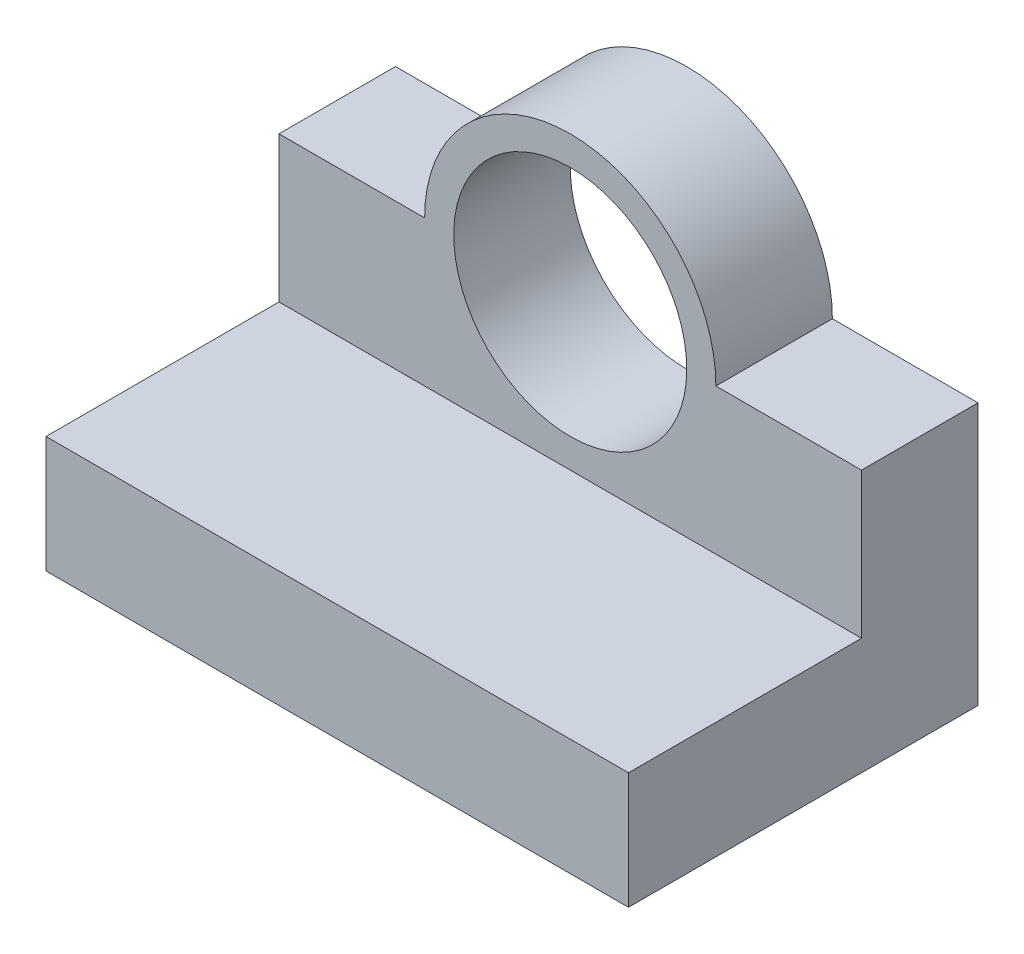
ISO-10303-21;
HEADER;
FILE_DESCRIPTION(('STEP AP214'),'2;1');
FILE_NAME('part.step','',(''),(''),'','','');
FILE_SCHEMA(('AUTOMOTIVE_DESIGN { 1 0 10303 214 1 1 1 1 }'));
ENDSEC;
DATA;
#1=APPLICATION_CONTEXT('core data for automotive mechanical design processes');
#2=APPLICATION_PROTOCOL_DEFINITION('international standard','automotive_design',2000,#1);
#3=PRODUCT_CONTEXT('',#1,'mechanical');
#4=PRODUCT('Part','Part','',(#3));
#5=PRODUCT_RELATED_PRODUCT_CATEGORY('part','',(#4));
#6=PRODUCT_DEFINITION_FORMATION('','',#4);
#7=PRODUCT_DEFINITION_CONTEXT('part definition',#1,'design');
#8=PRODUCT_DEFINITION('design','',#6,#7);
#9=PRODUCT_DEFINITION_SHAPE('','',#8);
#10=(LENGTH_UNIT() NAMED_UNIT(*) SI_UNIT(.MILLI.,.METRE.));
#11=(NAMED_UNIT(*) PLANE_ANGLE_UNIT() SI_UNIT($,.RADIAN.));
#12=(NAMED_UNIT(*) SI_UNIT($,.STERADIAN.) SOLID_ANGLE_UNIT());
#13=UNCERTAINTY_MEASURE_WITH_UNIT(LENGTH_MEASURE(1.E-05),#10,'distance_accuracy_value','');
#14=(GEOMETRIC_REPRESENTATION_CONTEXT(3) GLOBAL_UNCERTAINTY_ASSIGNED_CONTEXT((#13)) GLOBAL_UNIT_ASSIGNED_CONTEXT((#10,
#11,#12)) REPRESENTATION_CONTEXT('',''));
#15=CARTESIAN_POINT('',(0.,0.,0.));
#16=DIRECTION('',(0.,0.,1.));
#17=DIRECTION('',(1.,0.,0.));
#18=AXIS2_PLACEMENT_3D('',#15,#16,#17);
#19=CARTESIAN_POINT('',(100.,-35.,-30.));
#20=DIRECTION('',(0.,0.,1.));
#21=DIRECTION('',(1.,0.,0.));
#22=AXIS2_PLACEMENT_3D('',#19,#20,#21);
#23=PLANE('',#22);
#24=CARTESIAN_POINT('',(50.,10.,-30.));
#25=DIRECTION('',(0.,0.,1.));
#26=DIRECTION('',(1.,0.,0.));
#27=AXIS2_PLACEMENT_3D('',#24,#25,#26);
#28=CIRCLE('',#27,20.);
#29=CARTESIAN_POINT('',(70.,10.,-30.));
#30=VERTEX_POINT('',#29);
#31=EDGE_CURVE('E142',#30,#30,#28,.T.);
#32=ORIENTED_EDGE('',*,*,#31,.T.);
#33=EDGE_LOOP('',(#32));
#34=FACE_BOUND('',#33,.T.);
#35=CARTESIAN_POINT('',(50.,10.,-30.));
#36=DIRECTION('',(0.,0.,1.));
#37=DIRECTION('',(1.,0.,0.));
#38=AXIS2_PLACEMENT_3D('',#35,#36,#37);
#39=CIRCLE('',#38,25.);
#40=CARTESIAN_POINT('',(75.,10.,-30.));
#41=VERTEX_POINT('',#40);
#42=CARTESIAN_POINT('',(25.,10.,-30.));
#43=VERTEX_POINT('',#42);
#44=EDGE_CURVE('E115',#41,#43,#39,.T.);
#45=ORIENTED_EDGE('',*,*,#44,.F.);
#46=DIRECTION('',(1.,0.,0.));
#47=VECTOR('',#46,1.);
#48=CARTESIAN_POINT('',(0.,9.99999999999999,-30.));
#49=LINE('',#48,#47);
#50=CARTESIAN_POINT('',(100.,10.,-30.));
#51=VERTEX_POINT('',#50);
#52=EDGE_CURVE('E119',#41,#51,#49,.T.);
#53=ORIENTED_EDGE('',*,*,#52,.T.);
#54=DIRECTION('',(0.,1.,0.));
#55=VECTOR('',#54,1.);
#56=CARTESIAN_POINT('',(100.,-35.,-30.));
#57=LINE('',#56,#55);
#58=CARTESIAN_POINT('',(100.,-35.,-30.));
#59=VERTEX_POINT('',#58);
#60=EDGE_CURVE('E160',#59,#51,#57,.T.);
#61=ORIENTED_EDGE('',*,*,#60,.F.);
#62=DIRECTION('',(-1.,0.,0.));
#63=VECTOR('',#62,1.);
#64=CARTESIAN_POINT('',(100.,-35.,-30.));
#65=LINE('',#64,#63);
#66=CARTESIAN_POINT('',(0.,-35.,-30.));
#67=VERTEX_POINT('',#66);
#68=EDGE_CURVE('E173',#59,#67,#65,.T.);
#69=ORIENTED_EDGE('',*,*,#68,.T.);
#70=DIRECTION('',(0.,1.,0.));
#71=VECTOR('',#70,1.);
#72=CARTESIAN_POINT('',(0.,-35.,-30.));
#73=LINE('',#72,#71);
#74=CARTESIAN_POINT('',(0.,9.99999999999999,-30.));
#75=VERTEX_POINT('',#74);
#76=EDGE_CURVE('E157',#67,#75,#73,.T.);
#77=ORIENTED_EDGE('',*,*,#76,.T.);
#78=DIRECTION('',(1.,0.,0.));
#79=VECTOR('',#78,1.);
#80=CARTESIAN_POINT('',(0.,10.,-30.));
#81=LINE('',#80,#79);
#82=EDGE_CURVE('E55',#75,#43,#81,.T.);
#83=ORIENTED_EDGE('',*,*,#82,.T.);
#84=EDGE_LOOP('',(#45,#53,#61,#69,#77,#83));
#85=FACE_BOUND('',#84,.T.);
#86=ADVANCED_FACE('F39',(#34,#85),#23,.F.);
#87=CARTESIAN_POINT('',(100.,35.,-9.99999999999999));
#88=DIRECTION('',(0.,0.,-1.));
#89=DIRECTION('',(0.,1.,0.));
#90=AXIS2_PLACEMENT_3D('',#87,#88,#89);
#91=PLANE('',#90);
#92=CARTESIAN_POINT('',(50.,10.,-9.99999999999999));
#93=DIRECTION('',(0.,0.,-1.));
#94=DIRECTION('',(0.,1.,0.));
#95=AXIS2_PLACEMENT_3D('',#92,#93,#94);
#96=CIRCLE('',#95,20.);
#97=CARTESIAN_POINT('',(50.,30.,-9.99999999999999));
#98=VERTEX_POINT('',#97);
#99=EDGE_CURVE('E42',#98,#98,#96,.T.);
#100=ORIENTED_EDGE('',*,*,#99,.T.);
#101=EDGE_LOOP('',(#100));
#102=FACE_BOUND('',#101,.T.);
#103=DIRECTION('',(1.,0.,0.));
#104=VECTOR('',#103,1.);
#105=CARTESIAN_POINT('',(0.,9.99999999999999,-10.));
#106=LINE('',#105,#104);
#107=CARTESIAN_POINT('',(75.,10.,-10.));
#108=VERTEX_POINT('',#107);
#109=CARTESIAN_POINT('',(100.,10.,-10.));
#110=VERTEX_POINT('',#109);
#111=EDGE_CURVE('E137',#108,#110,#106,.T.);
#112=ORIENTED_EDGE('',*,*,#111,.F.);
#113=CARTESIAN_POINT('',(50.,10.,-10.));
#114=DIRECTION('',(0.,0.,1.));
#115=DIRECTION('',(1.,0.,0.));
#116=AXIS2_PLACEMENT_3D('',#113,#114,#115);
#117=CIRCLE('',#116,25.);
#118=CARTESIAN_POINT('',(25.,10.,-10.));
#119=VERTEX_POINT('',#118);
#120=EDGE_CURVE('E129',#108,#119,#117,.T.);
#121=ORIENTED_EDGE('',*,*,#120,.T.);
#122=DIRECTION('',(1.,0.,0.));
#123=VECTOR('',#122,1.);
#124=CARTESIAN_POINT('',(0.,10.,-10.));
#125=LINE('',#124,#123);
#126=CARTESIAN_POINT('',(0.,10.,-10.));
#127=VERTEX_POINT('',#126);
#128=EDGE_CURVE('E123',#127,#119,#125,.T.);
#129=ORIENTED_EDGE('',*,*,#128,.F.);
#130=DIRECTION('',(0.,-1.,0.));
#131=VECTOR('',#130,1.);
#132=CARTESIAN_POINT('',(0.,35.,-9.99999999999999));
#133=LINE('',#132,#131);
#134=CARTESIAN_POINT('',(0.,-15.,-10.));
#135=VERTEX_POINT('',#134);
#136=EDGE_CURVE('E176',#127,#135,#133,.T.);
#137=ORIENTED_EDGE('',*,*,#136,.T.);
#138=DIRECTION('',(-1.,0.,0.));
#139=VECTOR('',#138,1.);
#140=CARTESIAN_POINT('',(100.,-15.,-10.));
#141=LINE('',#140,#139);
#142=CARTESIAN_POINT('',(100.,-15.,-10.));
#143=VERTEX_POINT('',#142);
#144=EDGE_CURVE('E11',#143,#135,#141,.T.);
#145=ORIENTED_EDGE('',*,*,#144,.F.);
#146=DIRECTION('',(0.,-1.,0.));
#147=VECTOR('',#146,1.);
#148=CARTESIAN_POINT('',(100.,35.,-9.99999999999999));
#149=LINE('',#148,#147);
#150=EDGE_CURVE('E92',#110,#143,#149,.T.);
#151=ORIENTED_EDGE('',*,*,#150,.F.);
#152=EDGE_LOOP('',(#112,#121,#129,#137,#145,#151));
#153=FACE_BOUND('',#152,.T.);
#154=ADVANCED_FACE('F220',(#102,#153),#91,.F.);
#155=CARTESIAN_POINT('',(100.,-15.,30.));
#156=DIRECTION('',(0.,-1.,0.));
#157=DIRECTION('',(0.,0.,-1.));
#158=AXIS2_PLACEMENT_3D('',#155,#156,#157);
#159=PLANE('',#158);
#160=DIRECTION('',(0.,0.,1.));
#161=VECTOR('',#160,1.);
#162=CARTESIAN_POINT('',(0.,-15.,30.));
#163=LINE('',#162,#161);
#164=CARTESIAN_POINT('',(0.,-15.,30.));
#165=VERTEX_POINT('',#164);
#166=EDGE_CURVE('E179',#135,#165,#163,.T.);
#167=ORIENTED_EDGE('',*,*,#166,.T.);
#168=DIRECTION('',(-1.,0.,0.));
#169=VECTOR('',#168,1.);
#170=CARTESIAN_POINT('',(100.,-15.,30.));
#171=LINE('',#170,#169);
#172=CARTESIAN_POINT('',(100.,-15.,30.));
#173=VERTEX_POINT('',#172);
#174=EDGE_CURVE('E48',#173,#165,#171,.T.);
#175=ORIENTED_EDGE('',*,*,#174,.F.);
#176=DIRECTION('',(0.,0.,1.));
#177=VECTOR('',#176,1.);
#178=CARTESIAN_POINT('',(100.,-15.,30.));
#179=LINE('',#178,#177);
#180=EDGE_CURVE('E165',#143,#173,#179,.T.);
#181=ORIENTED_EDGE('',*,*,#180,.F.);
#182=ORIENTED_EDGE('',*,*,#144,.T.);
#183=EDGE_LOOP('',(#167,#175,#181,#182));
#184=FACE_BOUND('',#183,.T.);
#185=ADVANCED_FACE('F216',(#184),#159,.F.);
#186=CARTESIAN_POINT('',(100.,-35.,30.));
#187=DIRECTION('',(0.,0.,-1.));
#188=DIRECTION('',(-1.,0.,0.));
#189=AXIS2_PLACEMENT_3D('',#186,#187,#188);
#190=PLANE('',#189);
#191=DIRECTION('',(0.,-1.,0.));
#192=VECTOR('',#191,1.);
#193=CARTESIAN_POINT('',(0.,-35.,30.));
#194=LINE('',#193,#192);
#195=CARTESIAN_POINT('',(0.,-35.,30.));
#196=VERTEX_POINT('',#195);
#197=EDGE_CURVE('E182',#165,#196,#194,.T.);
#198=ORIENTED_EDGE('',*,*,#197,.T.);
#199=DIRECTION('',(-1.,0.,0.));
#200=VECTOR('',#199,1.);
#201=CARTESIAN_POINT('',(100.,-35.,30.));
#202=LINE('',#201,#200);
#203=CARTESIAN_POINT('',(100.,-35.,30.));
#204=VERTEX_POINT('',#203);
#205=EDGE_CURVE('E189',#204,#196,#202,.T.);
#206=ORIENTED_EDGE('',*,*,#205,.F.);
#207=DIRECTION('',(0.,-1.,0.));
#208=VECTOR('',#207,1.);
#209=CARTESIAN_POINT('',(100.,-35.,30.));
#210=LINE('',#209,#208);
#211=EDGE_CURVE('E168',#173,#204,#210,.T.);
#212=ORIENTED_EDGE('',*,*,#211,.F.);
#213=ORIENTED_EDGE('',*,*,#174,.T.);
#214=EDGE_LOOP('',(#198,#206,#212,#213));
#215=FACE_BOUND('',#214,.T.);
#216=ADVANCED_FACE('F198',(#215),#190,.F.);
#217=CARTESIAN_POINT('',(100.,-35.,30.));
#218=DIRECTION('',(0.,1.,0.));
#219=DIRECTION('',(0.,0.,1.));
#220=AXIS2_PLACEMENT_3D('',#217,#218,#219);
#221=PLANE('',#220);
#222=DIRECTION('',(0.,0.,-1.));
#223=VECTOR('',#222,1.);
#224=CARTESIAN_POINT('',(0.,-35.,30.));
#225=LINE('',#224,#223);
#226=EDGE_CURVE('E85',#196,#67,#225,.T.);
#227=ORIENTED_EDGE('',*,*,#226,.T.);
#228=ORIENTED_EDGE('',*,*,#68,.F.);
#229=DIRECTION('',(0.,0.,-1.));
#230=VECTOR('',#229,1.);
#231=CARTESIAN_POINT('',(100.,-35.,30.));
#232=LINE('',#231,#230);
#233=EDGE_CURVE('E64',#204,#59,#232,.T.);
#234=ORIENTED_EDGE('',*,*,#233,.F.);
#235=ORIENTED_EDGE('',*,*,#205,.T.);
#236=EDGE_LOOP('',(#227,#228,#234,#235));
#237=FACE_BOUND('',#236,.T.);
#238=ADVANCED_FACE('F207',(#237),#221,.F.);
#239=CARTESIAN_POINT('',(100.,0.,0.));
#240=DIRECTION('',(-1.,0.,0.));
#241=DIRECTION('',(0.,0.,1.));
#242=AXIS2_PLACEMENT_3D('',#239,#240,#241);
#243=PLANE('',#242);
#244=ORIENTED_EDGE('',*,*,#60,.T.);
#245=DIRECTION('',(0.,0.,1.));
#246=VECTOR('',#245,1.);
#247=CARTESIAN_POINT('',(100.,10.,-30.));
#248=LINE('',#247,#246);
#249=EDGE_CURVE('E133',#51,#110,#248,.T.);
#250=ORIENTED_EDGE('',*,*,#249,.T.);
#251=ORIENTED_EDGE('',*,*,#150,.T.);
#252=ORIENTED_EDGE('',*,*,#180,.T.);
#253=ORIENTED_EDGE('',*,*,#211,.T.);
#254=ORIENTED_EDGE('',*,*,#233,.T.);
#255=EDGE_LOOP('',(#244,#250,#251,#252,#253,#254));
#256=FACE_BOUND('',#255,.T.);
#257=ADVANCED_FACE('F209',(#256),#243,.F.);
#258=CARTESIAN_POINT('',(0.,0.,0.));
#259=DIRECTION('',(-1.,0.,0.));
#260=DIRECTION('',(0.,0.,1.));
#261=AXIS2_PLACEMENT_3D('',#258,#259,#260);
#262=PLANE('',#261);
#263=DIRECTION('',(0.,0.,1.));
#264=VECTOR('',#263,1.);
#265=CARTESIAN_POINT('',(0.,10.,-30.));
#266=LINE('',#265,#264);
#267=EDGE_CURVE('E148',#75,#127,#266,.T.);
#268=ORIENTED_EDGE('',*,*,#267,.F.);
#269=ORIENTED_EDGE('',*,*,#76,.F.);
#270=ORIENTED_EDGE('',*,*,#226,.F.);
#271=ORIENTED_EDGE('',*,*,#197,.F.);
#272=ORIENTED_EDGE('',*,*,#166,.F.);
#273=ORIENTED_EDGE('',*,*,#136,.F.);
#274=EDGE_LOOP('',(#268,#269,#270,#271,#272,#273));
#275=FACE_BOUND('',#274,.T.);
#276=ADVANCED_FACE('F204',(#275),#262,.T.);
#277=CARTESIAN_POINT('',(50.,10.,-30.));
#278=DIRECTION('',(0.,0.,1.));
#279=DIRECTION('',(1.,0.,0.));
#280=AXIS2_PLACEMENT_3D('',#277,#278,#279);
#281=CYLINDRICAL_SURFACE('',#280,25.);
#282=ORIENTED_EDGE('',*,*,#120,.F.);
#283=DIRECTION('',(0.,0.,1.));
#284=VECTOR('',#283,1.);
#285=CARTESIAN_POINT('',(75.,10.,-30.));
#286=LINE('',#285,#284);
#287=EDGE_CURVE('E126',#41,#108,#286,.T.);
#288=ORIENTED_EDGE('',*,*,#287,.F.);
#289=ORIENTED_EDGE('',*,*,#44,.T.);
#290=DIRECTION('',(0.,0.,1.));
#291=VECTOR('',#290,1.);
#292=CARTESIAN_POINT('',(25.,10.,-30.));
#293=LINE('',#292,#291);
#294=EDGE_CURVE('E154',#43,#119,#293,.T.);
#295=ORIENTED_EDGE('',*,*,#294,.T.);
#296=EDGE_LOOP('',(#282,#288,#289,#295));
#297=FACE_BOUND('',#296,.T.);
#298=ADVANCED_FACE('F127',(#297),#281,.T.);
#299=CARTESIAN_POINT('',(0.,10.,-30.));
#300=DIRECTION('',(0.,-1.,0.));
#301=DIRECTION('',(1.,0.,0.));
#302=AXIS2_PLACEMENT_3D('',#299,#300,#301);
#303=PLANE('',#302);
#304=ORIENTED_EDGE('',*,*,#128,.T.);
#305=ORIENTED_EDGE('',*,*,#294,.F.);
#306=ORIENTED_EDGE('',*,*,#82,.F.);
#307=ORIENTED_EDGE('',*,*,#267,.T.);
#308=EDGE_LOOP('',(#304,#305,#306,#307));
#309=FACE_BOUND('',#308,.T.);
#310=ADVANCED_FACE('F241',(#309),#303,.F.);
#311=CARTESIAN_POINT('',(0.,9.99999999999999,-30.));
#312=DIRECTION('',(0.,-1.,0.));
#313=DIRECTION('',(1.,0.,0.));
#314=AXIS2_PLACEMENT_3D('',#311,#312,#313);
#315=PLANE('',#314);
#316=ORIENTED_EDGE('',*,*,#111,.T.);
#317=ORIENTED_EDGE('',*,*,#249,.F.);
#318=ORIENTED_EDGE('',*,*,#52,.F.);
#319=ORIENTED_EDGE('',*,*,#287,.T.);
#320=EDGE_LOOP('',(#316,#317,#318,#319));
#321=FACE_BOUND('',#320,.T.);
#322=ADVANCED_FACE('F135',(#321),#315,.F.);
#323=CARTESIAN_POINT('',(50.,10.,-30.));
#324=DIRECTION('',(0.,0.,1.));
#325=DIRECTION('',(1.,0.,0.));
#326=AXIS2_PLACEMENT_3D('',#323,#324,#325);
#327=CYLINDRICAL_SURFACE('',#326,20.);
#328=ORIENTED_EDGE('',*,*,#31,.F.);
#329=EDGE_LOOP('',(#328));
#330=FACE_BOUND('',#329,.T.);
#331=ORIENTED_EDGE('',*,*,#99,.F.);
#332=EDGE_LOOP('',(#331));
#333=FACE_BOUND('',#332,.T.);
#334=ADVANCED_FACE('F235',(#330,#333),#327,.F.);
#335=CLOSED_SHELL('',(#86,#154,#185,#216,#238,#257,#276,#298,#310,#322,#334));
#336=MANIFOLD_SOLID_BREP('B2',#335);
#337=ADVANCED_BREP_SHAPE_REPRESENTATION('',(#18,#336),#14);
#338=SHAPE_DEFINITION_REPRESENTATION(#9,#337);
ENDSEC;
END-ISO-10303-21;
